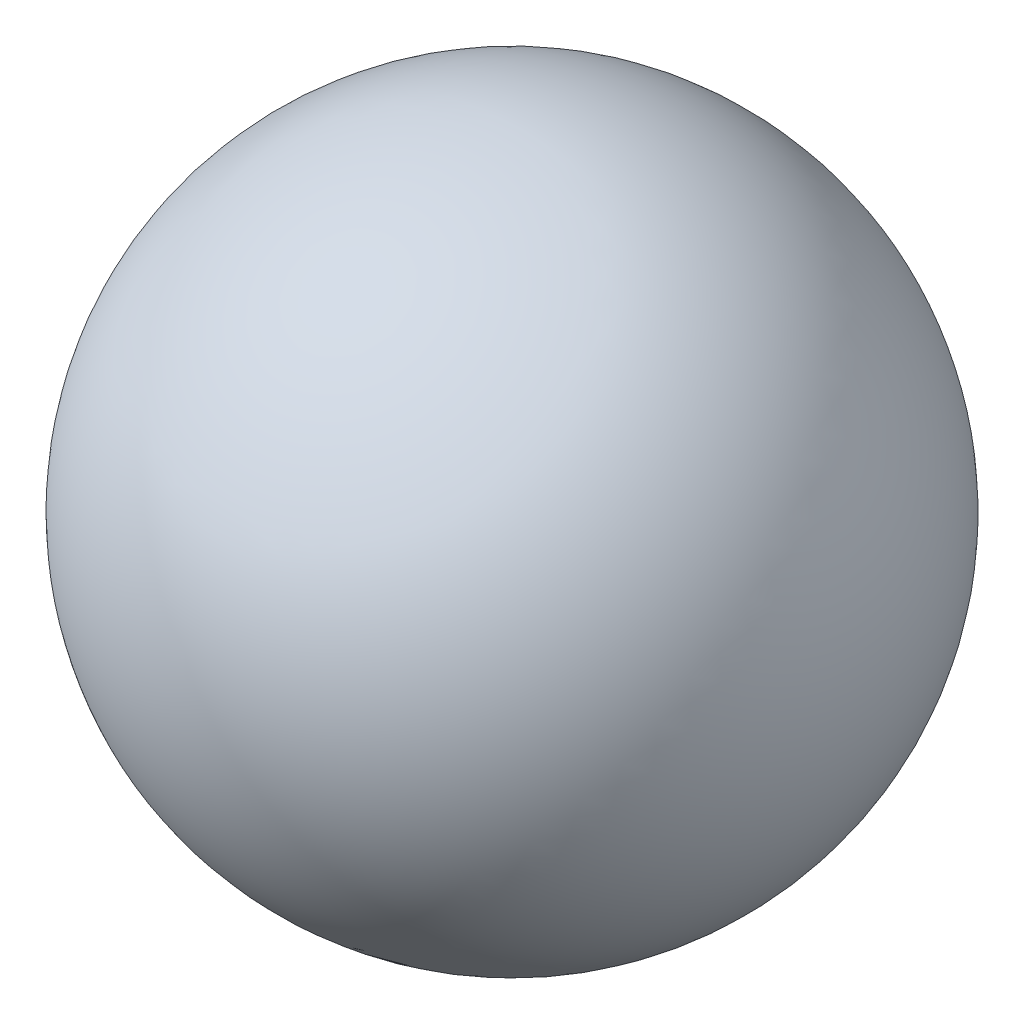
ISO-10303-21;
HEADER;
FILE_DESCRIPTION(('STEP AP214'),'2;1');
FILE_NAME('part.step','',(''),(''),'','','');
FILE_SCHEMA(('AUTOMOTIVE_DESIGN { 1 0 10303 214 1 1 1 1 }'));
ENDSEC;
DATA;
#1=APPLICATION_CONTEXT('core data for automotive mechanical design processes');
#2=APPLICATION_PROTOCOL_DEFINITION('international standard','automotive_design',2000,#1);
#3=PRODUCT_CONTEXT('',#1,'mechanical');
#4=PRODUCT('Part','Part','',(#3));
#5=PRODUCT_RELATED_PRODUCT_CATEGORY('part','',(#4));
#6=PRODUCT_DEFINITION_FORMATION('','',#4);
#7=PRODUCT_DEFINITION_CONTEXT('part definition',#1,'design');
#8=PRODUCT_DEFINITION('design','',#6,#7);
#9=PRODUCT_DEFINITION_SHAPE('','',#8);
#10=(LENGTH_UNIT() NAMED_UNIT(*) SI_UNIT(.MILLI.,.METRE.));
#11=(NAMED_UNIT(*) PLANE_ANGLE_UNIT() SI_UNIT($,.RADIAN.));
#12=(NAMED_UNIT(*) SI_UNIT($,.STERADIAN.) SOLID_ANGLE_UNIT());
#13=UNCERTAINTY_MEASURE_WITH_UNIT(LENGTH_MEASURE(1.E-05),#10,'distance_accuracy_value','');
#14=(GEOMETRIC_REPRESENTATION_CONTEXT(3) GLOBAL_UNCERTAINTY_ASSIGNED_CONTEXT((#13)) GLOBAL_UNIT_ASSIGNED_CONTEXT((#10,
#11,#12)) REPRESENTATION_CONTEXT('',''));
#15=CARTESIAN_POINT('',(0.,0.,0.));
#16=DIRECTION('',(0.,0.,1.));
#17=DIRECTION('',(1.,0.,0.));
#18=AXIS2_PLACEMENT_3D('',#15,#16,#17);
#19=CARTESIAN_POINT('',(57.535,7.84626356557586,61.0291867904982));
#20=DIRECTION('',(0.,0.127516208211662,0.99183648684817));
#21=DIRECTION('',(0.173648177666933,-0.976768261968468,0.125578950481564));
#22=AXIS2_PLACEMENT_3D('',#19,#20,#21);
#23=SPHERICAL_SURFACE('',#22,6.75);
#24=CARTESIAN_POINT('',(57.535,8.70699797100458,67.7240830767234));
#25=VERTEX_POINT('',#24);
#26=VERTEX_LOOP('',#25);
#27=FACE_BOUND('',#26,.T.);
#28=CARTESIAN_POINT('',(57.535,6.98552916014714,54.3342905042731));
#29=VERTEX_POINT('',#28);
#30=VERTEX_LOOP('',#29);
#31=FACE_BOUND('',#30,.T.);
#32=ADVANCED_FACE('F16',(#27,#31),#23,.T.);
#33=CLOSED_SHELL('',(#32));
#34=MANIFOLD_SOLID_BREP('B1',#33);
#35=ADVANCED_BREP_SHAPE_REPRESENTATION('',(#18,#34),#14);
#36=SHAPE_DEFINITION_REPRESENTATION(#9,#35);
ENDSEC;
END-ISO-10303-21;
